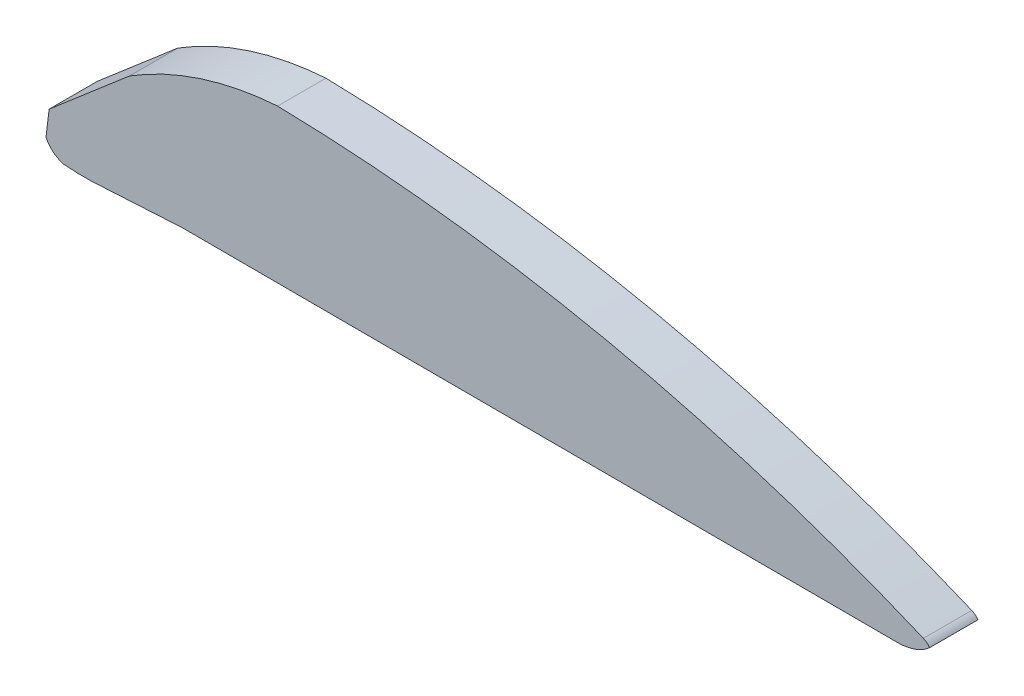
ISO-10303-21;
HEADER;
FILE_DESCRIPTION(('STEP AP214'),'2;1');
FILE_NAME('part.step','',(''),(''),'','','');
FILE_SCHEMA(('AUTOMOTIVE_DESIGN { 1 0 10303 214 1 1 1 1 }'));
ENDSEC;
DATA;
#1=APPLICATION_CONTEXT('core data for automotive mechanical design processes');
#2=APPLICATION_PROTOCOL_DEFINITION('international standard','automotive_design',2000,#1);
#3=PRODUCT_CONTEXT('',#1,'mechanical');
#4=PRODUCT('Part','Part','',(#3));
#5=PRODUCT_RELATED_PRODUCT_CATEGORY('part','',(#4));
#6=PRODUCT_DEFINITION_FORMATION('','',#4);
#7=PRODUCT_DEFINITION_CONTEXT('part definition',#1,'design');
#8=PRODUCT_DEFINITION('design','',#6,#7);
#9=PRODUCT_DEFINITION_SHAPE('','',#8);
#10=(LENGTH_UNIT() NAMED_UNIT(*) SI_UNIT(.MILLI.,.METRE.));
#11=(NAMED_UNIT(*) PLANE_ANGLE_UNIT() SI_UNIT($,.RADIAN.));
#12=(NAMED_UNIT(*) SI_UNIT($,.STERADIAN.) SOLID_ANGLE_UNIT());
#13=UNCERTAINTY_MEASURE_WITH_UNIT(LENGTH_MEASURE(1.E-05),#10,'distance_accuracy_value','');
#14=(GEOMETRIC_REPRESENTATION_CONTEXT(3) GLOBAL_UNCERTAINTY_ASSIGNED_CONTEXT((#13)) GLOBAL_UNIT_ASSIGNED_CONTEXT((#10,
#11,#12)) REPRESENTATION_CONTEXT('',''));
#15=CARTESIAN_POINT('',(0.,0.,0.));
#16=DIRECTION('',(0.,0.,1.));
#17=DIRECTION('',(1.,0.,0.));
#18=AXIS2_PLACEMENT_3D('',#15,#16,#17);
#19=CARTESIAN_POINT('',(18.0339391113454,9.07676939416005,35.));
#20=DIRECTION('',(0.,0.,-1.));
#21=DIRECTION('',(-1.,0.,0.));
#22=AXIS2_PLACEMENT_3D('',#19,#20,#21);
#23=CYLINDRICAL_SURFACE('',#22,20.1893710280057);
#24=CARTESIAN_POINT('',(18.0339391113454,9.07676939416005,0.));
#25=DIRECTION('',(0.,0.,1.));
#26=DIRECTION('',(1.,0.,0.));
#27=AXIS2_PLACEMENT_3D('',#24,#25,#26);
#28=CIRCLE('',#27,20.1893710280057);
#29=CARTESIAN_POINT('',(0.,0.,0.));
#30=VERTEX_POINT('',#29);
#31=CARTESIAN_POINT('',(12.5532158193345,-10.3544522530469,0.));
#32=VERTEX_POINT('',#31);
#33=EDGE_CURVE('E152',#30,#32,#28,.T.);
#34=ORIENTED_EDGE('',*,*,#33,.T.);
#35=DIRECTION('',(0.,0.,-1.));
#36=VECTOR('',#35,1.);
#37=CARTESIAN_POINT('',(12.5532158193345,-10.3544522530469,35.));
#38=LINE('',#37,#36);
#39=CARTESIAN_POINT('',(12.5532158193345,-10.3544522530469,35.));
#40=VERTEX_POINT('',#39);
#41=EDGE_CURVE('E11',#40,#32,#38,.T.);
#42=ORIENTED_EDGE('',*,*,#41,.F.);
#43=CARTESIAN_POINT('',(18.0339391113454,9.07676939416005,35.));
#44=DIRECTION('',(0.,0.,1.));
#45=DIRECTION('',(1.,0.,0.));
#46=AXIS2_PLACEMENT_3D('',#43,#44,#45);
#47=CIRCLE('',#46,20.1893710280057);
#48=CARTESIAN_POINT('',(0.,0.,35.));
#49=VERTEX_POINT('',#48);
#50=EDGE_CURVE('E172',#49,#40,#47,.T.);
#51=ORIENTED_EDGE('',*,*,#50,.F.);
#52=DIRECTION('',(0.,0.,-1.));
#53=VECTOR('',#52,1.);
#54=CARTESIAN_POINT('',(0.,0.,35.));
#55=LINE('',#54,#53);
#56=EDGE_CURVE('E148',#49,#30,#55,.T.);
#57=ORIENTED_EDGE('',*,*,#56,.T.);
#58=EDGE_LOOP('',(#34,#42,#51,#57));
#59=FACE_BOUND('',#58,.T.);
#60=ADVANCED_FACE('F38',(#59),#23,.T.);
#61=CARTESIAN_POINT('',(28.028820781833,166.585041779823,35.));
#62=DIRECTION('',(0.,0.,-1.));
#63=DIRECTION('',(-1.,0.,0.));
#64=AXIS2_PLACEMENT_3D('',#61,#62,#63);
#65=CYLINDRICAL_SURFACE('',#64,177.614973742541);
#66=CARTESIAN_POINT('',(28.028820781833,166.585041779823,0.));
#67=DIRECTION('',(0.,0.,1.));
#68=DIRECTION('',(1.,0.,0.));
#69=AXIS2_PLACEMENT_3D('',#66,#67,#68);
#70=CIRCLE('',#69,177.614973742541);
#71=CARTESIAN_POINT('',(43.5044257443313,-10.3544522530469,0.));
#72=VERTEX_POINT('',#71);
#73=EDGE_CURVE('E155',#32,#72,#70,.T.);
#74=ORIENTED_EDGE('',*,*,#73,.T.);
#75=DIRECTION('',(0.,0.,-1.));
#76=VECTOR('',#75,1.);
#77=CARTESIAN_POINT('',(43.5044257443313,-10.3544522530469,35.));
#78=LINE('',#77,#76);
#79=CARTESIAN_POINT('',(43.5044257443313,-10.3544522530469,35.));
#80=VERTEX_POINT('',#79);
#81=EDGE_CURVE('E46',#80,#72,#78,.T.);
#82=ORIENTED_EDGE('',*,*,#81,.F.);
#83=CARTESIAN_POINT('',(28.028820781833,166.585041779823,35.));
#84=DIRECTION('',(0.,0.,1.));
#85=DIRECTION('',(1.,0.,0.));
#86=AXIS2_PLACEMENT_3D('',#83,#84,#85);
#87=CIRCLE('',#86,177.614973742541);
#88=EDGE_CURVE('E106',#40,#80,#87,.T.);
#89=ORIENTED_EDGE('',*,*,#88,.F.);
#90=ORIENTED_EDGE('',*,*,#41,.T.);
#91=EDGE_LOOP('',(#74,#82,#89,#90));
#92=FACE_BOUND('',#91,.T.);
#93=ADVANCED_FACE('F244',(#92),#65,.T.);
#94=CARTESIAN_POINT('',(43.5044257443313,-10.3544522530469,35.));
#95=DIRECTION('',(-0.055898777119421,0.998436440999903,0.));
#96=DIRECTION('',(-0.998436440999903,-0.055898777119421,0.));
#97=AXIS2_PLACEMENT_3D('',#94,#95,#96);
#98=PLANE('',#97);
#99=DIRECTION('',(0.998436440999903,0.055898777119421,0.));
#100=VECTOR('',#99,1.);
#101=CARTESIAN_POINT('',(43.5044257443313,-10.3544522530469,0.));
#102=LINE('',#101,#100);
#103=CARTESIAN_POINT('',(98.9268072783587,-7.2515573409827,0.));
#104=VERTEX_POINT('',#103);
#105=EDGE_CURVE('E157',#72,#104,#102,.T.);
#106=ORIENTED_EDGE('',*,*,#105,.T.);
#107=DIRECTION('',(0.,0.,-1.));
#108=VECTOR('',#107,1.);
#109=CARTESIAN_POINT('',(98.9268072783587,-7.2515573409827,35.));
#110=LINE('',#109,#108);
#111=CARTESIAN_POINT('',(98.9268072783587,-7.2515573409827,35.));
#112=VERTEX_POINT('',#111);
#113=EDGE_CURVE('E188',#112,#104,#110,.T.);
#114=ORIENTED_EDGE('',*,*,#113,.F.);
#115=DIRECTION('',(0.998436440999903,0.055898777119421,0.));
#116=VECTOR('',#115,1.);
#117=CARTESIAN_POINT('',(43.5044257443313,-10.3544522530469,35.));
#118=LINE('',#117,#116);
#119=EDGE_CURVE('E196',#80,#112,#118,.T.);
#120=ORIENTED_EDGE('',*,*,#119,.F.);
#121=ORIENTED_EDGE('',*,*,#81,.T.);
#122=EDGE_LOOP('',(#106,#114,#120,#121));
#123=FACE_BOUND('',#122,.T.);
#124=ADVANCED_FACE('F194',(#123),#98,.F.);
#125=CARTESIAN_POINT('',(619.494818873616,-8.42482848483324,35.));
#126=DIRECTION('',(0.00225382301211317,0.99999746013769,0.));
#127=DIRECTION('',(-0.99999746013769,0.00225382301211317,0.));
#128=AXIS2_PLACEMENT_3D('',#125,#126,#127);
#129=PLANE('',#128);
#130=DIRECTION('',(0.999997460137689,-0.00225382301211317,0.));
#131=VECTOR('',#130,1.);
#132=CARTESIAN_POINT('',(619.494818873616,-8.42482848483324,0.));
#133=LINE('',#132,#131);
#134=CARTESIAN_POINT('',(619.494818873616,-8.42482848483325,0.));
#135=VERTEX_POINT('',#134);
#136=EDGE_CURVE('E159',#104,#135,#133,.T.);
#137=ORIENTED_EDGE('',*,*,#136,.T.);
#138=DIRECTION('',(0.,0.,-1.));
#139=VECTOR('',#138,1.);
#140=CARTESIAN_POINT('',(619.494818873616,-8.42482848483325,35.));
#141=LINE('',#140,#139);
#142=CARTESIAN_POINT('',(619.494818873616,-8.42482848483325,35.));
#143=VERTEX_POINT('',#142);
#144=EDGE_CURVE('E185',#143,#135,#141,.T.);
#145=ORIENTED_EDGE('',*,*,#144,.F.);
#146=DIRECTION('',(0.999997460137689,-0.00225382301211317,0.));
#147=VECTOR('',#146,1.);
#148=CARTESIAN_POINT('',(619.494818873616,-8.42482848483324,35.));
#149=LINE('',#148,#147);
#150=EDGE_CURVE('E214',#112,#143,#149,.T.);
#151=ORIENTED_EDGE('',*,*,#150,.F.);
#152=ORIENTED_EDGE('',*,*,#113,.T.);
#153=EDGE_LOOP('',(#137,#145,#151,#152));
#154=FACE_BOUND('',#153,.T.);
#155=ADVANCED_FACE('F205',(#154),#129,.F.);
#156=CARTESIAN_POINT('',(611.127267107389,50.5886053981241,35.));
#157=DIRECTION('',(0.,0.,-1.));
#158=DIRECTION('',(-1.,0.,0.));
#159=AXIS2_PLACEMENT_3D('',#156,#157,#158);
#160=CYLINDRICAL_SURFACE('',#159,59.6037020764537);
#161=CARTESIAN_POINT('',(611.127267107389,50.5886053981241,0.));
#162=DIRECTION('',(0.,0.,1.));
#163=DIRECTION('',(1.,0.,0.));
#164=AXIS2_PLACEMENT_3D('',#161,#162,#163);
#165=CIRCLE('',#164,59.6037020764537);
#166=CARTESIAN_POINT('',(623.989844606865,-7.61066780428486,0.));
#167=VERTEX_POINT('',#166);
#168=EDGE_CURVE('E161',#135,#167,#165,.T.);
#169=ORIENTED_EDGE('',*,*,#168,.T.);
#170=DIRECTION('',(0.,0.,-1.));
#171=VECTOR('',#170,1.);
#172=CARTESIAN_POINT('',(623.989844606865,-7.61066780428486,35.));
#173=LINE('',#172,#171);
#174=CARTESIAN_POINT('',(623.989844606865,-7.61066780428486,35.));
#175=VERTEX_POINT('',#174);
#176=EDGE_CURVE('E182',#175,#167,#173,.T.);
#177=ORIENTED_EDGE('',*,*,#176,.F.);
#178=CARTESIAN_POINT('',(611.127267107389,50.5886053981241,35.));
#179=DIRECTION('',(0.,0.,1.));
#180=DIRECTION('',(1.,0.,0.));
#181=AXIS2_PLACEMENT_3D('',#178,#179,#180);
#182=CIRCLE('',#181,59.6037020764537);
#183=EDGE_CURVE('E211',#143,#175,#182,.T.);
#184=ORIENTED_EDGE('',*,*,#183,.F.);
#185=ORIENTED_EDGE('',*,*,#144,.T.);
#186=EDGE_LOOP('',(#169,#177,#184,#185));
#187=FACE_BOUND('',#186,.T.);
#188=ADVANCED_FACE('F209',(#187),#160,.T.);
#189=CARTESIAN_POINT('',(619.603137951963,22.2626010238231,35.));
#190=DIRECTION('',(0.,0.,-1.));
#191=DIRECTION('',(-1.,0.,0.));
#192=AXIS2_PLACEMENT_3D('',#189,#190,#191);
#193=CYLINDRICAL_SURFACE('',#192,30.1936315429689);
#194=CARTESIAN_POINT('',(619.603137951963,22.2626010238231,0.));
#195=DIRECTION('',(0.,0.,1.));
#196=DIRECTION('',(1.,0.,0.));
#197=AXIS2_PLACEMENT_3D('',#194,#195,#196);
#198=CIRCLE('',#197,30.1936315429689);
#199=CARTESIAN_POINT('',(640.,0.,0.));
#200=VERTEX_POINT('',#199);
#201=EDGE_CURVE('E163',#167,#200,#198,.T.);
#202=ORIENTED_EDGE('',*,*,#201,.T.);
#203=DIRECTION('',(0.,0.,-1.));
#204=VECTOR('',#203,1.);
#205=CARTESIAN_POINT('',(640.,0.,35.));
#206=LINE('',#205,#204);
#207=CARTESIAN_POINT('',(640.,0.,35.));
#208=VERTEX_POINT('',#207);
#209=EDGE_CURVE('E179',#208,#200,#206,.T.);
#210=ORIENTED_EDGE('',*,*,#209,.F.);
#211=CARTESIAN_POINT('',(619.603137951963,22.2626010238231,35.));
#212=DIRECTION('',(0.,0.,1.));
#213=DIRECTION('',(1.,0.,0.));
#214=AXIS2_PLACEMENT_3D('',#211,#212,#213);
#215=CIRCLE('',#214,30.1936315429689);
#216=EDGE_CURVE('E213',#175,#208,#215,.T.);
#217=ORIENTED_EDGE('',*,*,#216,.F.);
#218=ORIENTED_EDGE('',*,*,#176,.T.);
#219=EDGE_LOOP('',(#202,#210,#217,#218));
#220=FACE_BOUND('',#219,.T.);
#221=ADVANCED_FACE('F257',(#220),#193,.T.);
#222=CARTESIAN_POINT('',(631.243232901876,-6.38178349848395,35.));
#223=DIRECTION('',(0.,0.,-1.));
#224=DIRECTION('',(-1.,0.,0.));
#225=AXIS2_PLACEMENT_3D('',#222,#223,#224);
#226=CYLINDRICAL_SURFACE('',#225,10.835503247764);
#227=CARTESIAN_POINT('',(631.243232901876,-6.38178349848395,0.));
#228=DIRECTION('',(0.,0.,1.));
#229=DIRECTION('',(-1.,0.,0.));
#230=AXIS2_PLACEMENT_3D('',#227,#228,#229);
#231=CIRCLE('',#230,10.835503247764);
#232=CARTESIAN_POINT('',(635.459190458335,3.59989133665484,0.));
#233=VERTEX_POINT('',#232);
#234=EDGE_CURVE('E165',#200,#233,#231,.T.);
#235=ORIENTED_EDGE('',*,*,#234,.T.);
#236=DIRECTION('',(0.,0.,-1.));
#237=VECTOR('',#236,1.);
#238=CARTESIAN_POINT('',(635.459190458335,3.59989133665484,35.));
#239=LINE('',#238,#237);
#240=CARTESIAN_POINT('',(635.459190458335,3.59989133665484,35.));
#241=VERTEX_POINT('',#240);
#242=EDGE_CURVE('E176',#241,#233,#239,.T.);
#243=ORIENTED_EDGE('',*,*,#242,.F.);
#244=CARTESIAN_POINT('',(631.243232901876,-6.38178349848395,35.));
#245=DIRECTION('',(0.,0.,1.));
#246=DIRECTION('',(-1.,0.,0.));
#247=AXIS2_PLACEMENT_3D('',#244,#245,#246);
#248=CIRCLE('',#247,10.835503247764);
#249=EDGE_CURVE('E216',#208,#241,#248,.T.);
#250=ORIENTED_EDGE('',*,*,#249,.F.);
#251=ORIENTED_EDGE('',*,*,#209,.T.);
#252=EDGE_LOOP('',(#235,#243,#250,#251));
#253=FACE_BOUND('',#252,.T.);
#254=ADVANCED_FACE('F225',(#253),#226,.T.);
#255=CARTESIAN_POINT('',(140.39554666766,-1168.50970626763,35.));
#256=DIRECTION('',(0.,0.,-1.));
#257=DIRECTION('',(-1.,0.,0.));
#258=AXIS2_PLACEMENT_3D('',#255,#256,#257);
#259=CYLINDRICAL_SURFACE('',#258,1272.3713766819);
#260=CARTESIAN_POINT('',(140.39554666766,-1168.50970626763,0.));
#261=DIRECTION('',(0.,0.,1.));
#262=DIRECTION('',(-1.,0.,0.));
#263=AXIS2_PLACEMENT_3D('',#260,#261,#262);
#264=CIRCLE('',#263,1272.3713766819);
#265=CARTESIAN_POINT('',(167.737234585348,103.56786695705,0.));
#266=VERTEX_POINT('',#265);
#267=EDGE_CURVE('E167',#233,#266,#264,.T.);
#268=ORIENTED_EDGE('',*,*,#267,.T.);
#269=DIRECTION('',(0.,0.,-1.));
#270=VECTOR('',#269,1.);
#271=CARTESIAN_POINT('',(167.737234585348,103.56786695705,35.));
#272=LINE('',#271,#270);
#273=CARTESIAN_POINT('',(167.737234585348,103.56786695705,35.));
#274=VERTEX_POINT('',#273);
#275=EDGE_CURVE('E143',#274,#266,#272,.T.);
#276=ORIENTED_EDGE('',*,*,#275,.F.);
#277=CARTESIAN_POINT('',(140.39554666766,-1168.50970626763,35.));
#278=DIRECTION('',(0.,0.,1.));
#279=DIRECTION('',(-1.,0.,0.));
#280=AXIS2_PLACEMENT_3D('',#277,#278,#279);
#281=CIRCLE('',#280,1272.3713766819);
#282=EDGE_CURVE('E134',#241,#274,#281,.T.);
#283=ORIENTED_EDGE('',*,*,#282,.F.);
#284=ORIENTED_EDGE('',*,*,#242,.T.);
#285=EDGE_LOOP('',(#268,#276,#283,#284));
#286=FACE_BOUND('',#285,.T.);
#287=ADVANCED_FACE('F229',(#286),#259,.T.);
#288=CARTESIAN_POINT('',(183.112828405963,-126.822295097474,35.));
#289=DIRECTION('',(0.,0.,-1.));
#290=DIRECTION('',(-1.,0.,0.));
#291=AXIS2_PLACEMENT_3D('',#288,#289,#290);
#292=CYLINDRICAL_SURFACE('',#291,230.902654070598);
#293=CARTESIAN_POINT('',(183.112828405963,-126.822295097474,0.));
#294=DIRECTION('',(0.,0.,1.));
#295=DIRECTION('',(-1.,0.,0.));
#296=AXIS2_PLACEMENT_3D('',#293,#294,#295);
#297=CIRCLE('',#296,230.902654070598);
#298=CARTESIAN_POINT('',(60.4579354499932,68.8095348556443,0.));
#299=VERTEX_POINT('',#298);
#300=EDGE_CURVE('E142',#266,#299,#297,.T.);
#301=ORIENTED_EDGE('',*,*,#300,.T.);
#302=DIRECTION('',(0.,0.,-1.));
#303=VECTOR('',#302,1.);
#304=CARTESIAN_POINT('',(60.4579354499932,68.8095348556443,35.));
#305=LINE('',#304,#303);
#306=CARTESIAN_POINT('',(60.4579354499932,68.8095348556443,35.));
#307=VERTEX_POINT('',#306);
#308=EDGE_CURVE('E139',#307,#299,#305,.T.);
#309=ORIENTED_EDGE('',*,*,#308,.F.);
#310=CARTESIAN_POINT('',(183.112828405963,-126.822295097474,35.));
#311=DIRECTION('',(0.,0.,1.));
#312=DIRECTION('',(-1.,0.,0.));
#313=AXIS2_PLACEMENT_3D('',#310,#311,#312);
#314=CIRCLE('',#313,230.902654070598);
#315=EDGE_CURVE('E128',#274,#307,#314,.T.);
#316=ORIENTED_EDGE('',*,*,#315,.F.);
#317=ORIENTED_EDGE('',*,*,#275,.T.);
#318=EDGE_LOOP('',(#301,#309,#316,#317));
#319=FACE_BOUND('',#318,.T.);
#320=ADVANCED_FACE('F140',(#319),#292,.T.);
#321=CARTESIAN_POINT('',(2.28079283751281,18.9265109317253,35.));
#322=DIRECTION('',(0.650918503976505,-0.759147614881973,0.));
#323=DIRECTION('',(0.759147614881973,0.650918503976505,0.));
#324=AXIS2_PLACEMENT_3D('',#321,#322,#323);
#325=PLANE('',#324);
#326=DIRECTION('',(-0.759147614881973,-0.650918503976506,0.));
#327=VECTOR('',#326,1.);
#328=CARTESIAN_POINT('',(2.28079283751281,18.9265109317253,0.));
#329=LINE('',#328,#327);
#330=CARTESIAN_POINT('',(2.28079283751281,18.9265109317253,0.));
#331=VERTEX_POINT('',#330);
#332=EDGE_CURVE('E92',#299,#331,#329,.T.);
#333=ORIENTED_EDGE('',*,*,#332,.T.);
#334=DIRECTION('',(0.,0.,-1.));
#335=VECTOR('',#334,1.);
#336=CARTESIAN_POINT('',(2.28079283751281,18.9265109317253,35.));
#337=LINE('',#336,#335);
#338=CARTESIAN_POINT('',(2.28079283751281,18.9265109317253,35.));
#339=VERTEX_POINT('',#338);
#340=EDGE_CURVE('E144',#339,#331,#337,.T.);
#341=ORIENTED_EDGE('',*,*,#340,.F.);
#342=DIRECTION('',(-0.759147614881973,-0.650918503976506,0.));
#343=VECTOR('',#342,1.);
#344=CARTESIAN_POINT('',(2.28079283751281,18.9265109317253,35.));
#345=LINE('',#344,#343);
#346=EDGE_CURVE('E132',#307,#339,#345,.T.);
#347=ORIENTED_EDGE('',*,*,#346,.F.);
#348=ORIENTED_EDGE('',*,*,#308,.T.);
#349=EDGE_LOOP('',(#333,#341,#347,#348));
#350=FACE_BOUND('',#349,.T.);
#351=ADVANCED_FACE('F146',(#350),#325,.F.);
#352=CARTESIAN_POINT('',(0.,0.,35.));
#353=DIRECTION('',(0.992817070596595,-0.11964223473337,0.));
#354=DIRECTION('',(0.11964223473337,0.992817070596596,0.));
#355=AXIS2_PLACEMENT_3D('',#352,#353,#354);
#356=PLANE('',#355);
#357=DIRECTION('',(-0.11964223473337,-0.992817070596596,0.));
#358=VECTOR('',#357,1.);
#359=CARTESIAN_POINT('',(0.,0.,0.));
#360=LINE('',#359,#358);
#361=EDGE_CURVE('E98',#331,#30,#360,.T.);
#362=ORIENTED_EDGE('',*,*,#361,.T.);
#363=ORIENTED_EDGE('',*,*,#56,.F.);
#364=DIRECTION('',(-0.11964223473337,-0.992817070596596,0.));
#365=VECTOR('',#364,1.);
#366=CARTESIAN_POINT('',(0.,0.,35.));
#367=LINE('',#366,#365);
#368=EDGE_CURVE('E54',#339,#49,#367,.T.);
#369=ORIENTED_EDGE('',*,*,#368,.F.);
#370=ORIENTED_EDGE('',*,*,#340,.T.);
#371=EDGE_LOOP('',(#362,#363,#369,#370));
#372=FACE_BOUND('',#371,.T.);
#373=ADVANCED_FACE('F233',(#372),#356,.F.);
#374=CARTESIAN_POINT('',(18.0339391113454,9.07676939416005,35.));
#375=DIRECTION('',(0.,0.,1.));
#376=DIRECTION('',(1.,0.,0.));
#377=AXIS2_PLACEMENT_3D('',#374,#375,#376);
#378=PLANE('',#377);
#379=ORIENTED_EDGE('',*,*,#50,.T.);
#380=ORIENTED_EDGE('',*,*,#88,.T.);
#381=ORIENTED_EDGE('',*,*,#119,.T.);
#382=ORIENTED_EDGE('',*,*,#150,.T.);
#383=ORIENTED_EDGE('',*,*,#183,.T.);
#384=ORIENTED_EDGE('',*,*,#216,.T.);
#385=ORIENTED_EDGE('',*,*,#249,.T.);
#386=ORIENTED_EDGE('',*,*,#282,.T.);
#387=ORIENTED_EDGE('',*,*,#315,.T.);
#388=ORIENTED_EDGE('',*,*,#346,.T.);
#389=ORIENTED_EDGE('',*,*,#368,.T.);
#390=EDGE_LOOP('',(#379,#380,#381,#382,#383,#384,#385,#386,#387,#388,#389));
#391=FACE_BOUND('',#390,.T.);
#392=ADVANCED_FACE('F130',(#391),#378,.T.);
#393=CARTESIAN_POINT('',(18.0339391113454,9.07676939416005,0.));
#394=DIRECTION('',(0.,0.,1.));
#395=DIRECTION('',(1.,0.,0.));
#396=AXIS2_PLACEMENT_3D('',#393,#394,#395);
#397=PLANE('',#396);
#398=ORIENTED_EDGE('',*,*,#33,.F.);
#399=ORIENTED_EDGE('',*,*,#361,.F.);
#400=ORIENTED_EDGE('',*,*,#332,.F.);
#401=ORIENTED_EDGE('',*,*,#300,.F.);
#402=ORIENTED_EDGE('',*,*,#267,.F.);
#403=ORIENTED_EDGE('',*,*,#234,.F.);
#404=ORIENTED_EDGE('',*,*,#201,.F.);
#405=ORIENTED_EDGE('',*,*,#168,.F.);
#406=ORIENTED_EDGE('',*,*,#136,.F.);
#407=ORIENTED_EDGE('',*,*,#105,.F.);
#408=ORIENTED_EDGE('',*,*,#73,.F.);
#409=EDGE_LOOP('',(#398,#399,#400,#401,#402,#403,#404,#405,#406,#407,#408));
#410=FACE_BOUND('',#409,.T.);
#411=ADVANCED_FACE('F200',(#410),#397,.F.);
#412=CLOSED_SHELL('',(#60,#93,#124,#155,#188,#221,#254,#287,#320,#351,#373,#392,#411));
#413=MANIFOLD_SOLID_BREP('B2',#412);
#414=ADVANCED_BREP_SHAPE_REPRESENTATION('',(#18,#413),#14);
#415=SHAPE_DEFINITION_REPRESENTATION(#9,#414);
ENDSEC;
END-ISO-10303-21;
